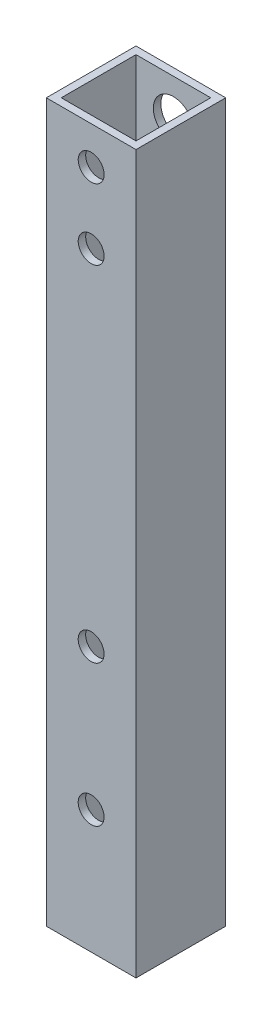
ISO-10303-21;
HEADER;
FILE_DESCRIPTION(('STEP AP214'),'2;1');
FILE_NAME('part.step','',(''),(''),'','','');
FILE_SCHEMA(('AUTOMOTIVE_DESIGN { 1 0 10303 214 1 1 1 1 }'));
ENDSEC;
DATA;
#1=APPLICATION_CONTEXT('core data for automotive mechanical design processes');
#2=APPLICATION_PROTOCOL_DEFINITION('international standard','automotive_design',2000,#1);
#3=PRODUCT_CONTEXT('',#1,'mechanical');
#4=PRODUCT('Part','Part','',(#3));
#5=PRODUCT_RELATED_PRODUCT_CATEGORY('part','',(#4));
#6=PRODUCT_DEFINITION_FORMATION('','',#4);
#7=PRODUCT_DEFINITION_CONTEXT('part definition',#1,'design');
#8=PRODUCT_DEFINITION('design','',#6,#7);
#9=PRODUCT_DEFINITION_SHAPE('','',#8);
#10=(LENGTH_UNIT() NAMED_UNIT(*) SI_UNIT(.MILLI.,.METRE.));
#11=(NAMED_UNIT(*) PLANE_ANGLE_UNIT() SI_UNIT($,.RADIAN.));
#12=(NAMED_UNIT(*) SI_UNIT($,.STERADIAN.) SOLID_ANGLE_UNIT());
#13=UNCERTAINTY_MEASURE_WITH_UNIT(LENGTH_MEASURE(1.E-05),#10,'distance_accuracy_value','');
#14=(GEOMETRIC_REPRESENTATION_CONTEXT(3) GLOBAL_UNCERTAINTY_ASSIGNED_CONTEXT((#13)) GLOBAL_UNIT_ASSIGNED_CONTEXT((#10,
#11,#12)) REPRESENTATION_CONTEXT('',''));
#15=CARTESIAN_POINT('',(0.,0.,0.));
#16=DIRECTION('',(0.,0.,1.));
#17=DIRECTION('',(1.,0.,0.));
#18=AXIS2_PLACEMENT_3D('',#15,#16,#17);
#19=CARTESIAN_POINT('',(0.,914.4,0.));
#20=DIRECTION('',(0.,-1.,0.));
#21=DIRECTION('',(0.,0.,-1.));
#22=AXIS2_PLACEMENT_3D('',#19,#20,#21);
#23=PLANE('',#22);
#24=DIRECTION('',(0.,0.,1.));
#25=VECTOR('',#24,1.);
#26=CARTESIAN_POINT('',(0.,914.4,0.));
#27=LINE('',#26,#25);
#28=CARTESIAN_POINT('',(0.,914.4,-19.05));
#29=VERTEX_POINT('',#28);
#30=CARTESIAN_POINT('',(0.,914.4,0.));
#31=VERTEX_POINT('',#30);
#32=EDGE_CURVE('E250',#29,#31,#27,.T.);
#33=ORIENTED_EDGE('',*,*,#32,.T.);
#34=DIRECTION('',(1.,0.,0.));
#35=VECTOR('',#34,1.);
#36=CARTESIAN_POINT('',(0.,914.4,0.));
#37=LINE('',#36,#35);
#38=CARTESIAN_POINT('',(19.05,914.4,0.));
#39=VERTEX_POINT('',#38);
#40=EDGE_CURVE('E254',#31,#39,#37,.T.);
#41=ORIENTED_EDGE('',*,*,#40,.T.);
#42=DIRECTION('',(0.,0.,-1.));
#43=VECTOR('',#42,1.);
#44=CARTESIAN_POINT('',(19.05,914.4,0.));
#45=LINE('',#44,#43);
#46=CARTESIAN_POINT('',(19.05,914.4,-19.05));
#47=VERTEX_POINT('',#46);
#48=EDGE_CURVE('E257',#39,#47,#45,.T.);
#49=ORIENTED_EDGE('',*,*,#48,.T.);
#50=DIRECTION('',(-1.,0.,0.));
#51=VECTOR('',#50,1.);
#52=CARTESIAN_POINT('',(0.,914.4,-19.05));
#53=LINE('',#52,#51);
#54=EDGE_CURVE('E133',#47,#29,#53,.T.);
#55=ORIENTED_EDGE('',*,*,#54,.T.);
#56=EDGE_LOOP('',(#33,#41,#49,#55));
#57=FACE_BOUND('',#56,.T.);
#58=DIRECTION('',(0.,0.,1.));
#59=VECTOR('',#58,1.);
#60=CARTESIAN_POINT('',(1.5875,914.4,-1.5875));
#61=LINE('',#60,#59);
#62=CARTESIAN_POINT('',(1.5875,914.4,-17.4625));
#63=VERTEX_POINT('',#62);
#64=CARTESIAN_POINT('',(1.5875,914.4,-1.5875));
#65=VERTEX_POINT('',#64);
#66=EDGE_CURVE('E221',#63,#65,#61,.T.);
#67=ORIENTED_EDGE('',*,*,#66,.F.);
#68=DIRECTION('',(-1.,0.,0.));
#69=VECTOR('',#68,1.);
#70=CARTESIAN_POINT('',(1.5875,914.4,-17.4625));
#71=LINE('',#70,#69);
#72=CARTESIAN_POINT('',(17.4625,914.4,-17.4625));
#73=VERTEX_POINT('',#72);
#74=EDGE_CURVE('E231',#73,#63,#71,.T.);
#75=ORIENTED_EDGE('',*,*,#74,.F.);
#76=DIRECTION('',(0.,0.,-1.));
#77=VECTOR('',#76,1.);
#78=CARTESIAN_POINT('',(17.4625,914.4,-1.5875));
#79=LINE('',#78,#77);
#80=CARTESIAN_POINT('',(17.4625,914.4,-1.5875));
#81=VERTEX_POINT('',#80);
#82=EDGE_CURVE('E227',#81,#73,#79,.T.);
#83=ORIENTED_EDGE('',*,*,#82,.F.);
#84=DIRECTION('',(1.,0.,0.));
#85=VECTOR('',#84,1.);
#86=CARTESIAN_POINT('',(1.5875,914.4,-1.5875));
#87=LINE('',#86,#85);
#88=EDGE_CURVE('E224',#65,#81,#87,.T.);
#89=ORIENTED_EDGE('',*,*,#88,.F.);
#90=EDGE_LOOP('',(#67,#75,#83,#89));
#91=FACE_BOUND('',#90,.T.);
#92=ADVANCED_FACE('F45',(#57,#91),#23,.F.);
#93=CARTESIAN_POINT('',(0.,914.4,0.));
#94=DIRECTION('',(1.,0.,0.));
#95=DIRECTION('',(0.,0.,-1.));
#96=AXIS2_PLACEMENT_3D('',#93,#94,#95);
#97=PLANE('',#96);
#98=DIRECTION('',(0.,-1.,0.));
#99=VECTOR('',#98,1.);
#100=CARTESIAN_POINT('',(0.,914.4,-19.05));
#101=LINE('',#100,#99);
#102=CARTESIAN_POINT('',(0.,762.,-19.05));
#103=VERTEX_POINT('',#102);
#104=EDGE_CURVE('E135',#29,#103,#101,.T.);
#105=ORIENTED_EDGE('',*,*,#104,.T.);
#106=DIRECTION('',(0.,0.,1.));
#107=VECTOR('',#106,1.);
#108=CARTESIAN_POINT('',(0.,762.,-19.05));
#109=LINE('',#108,#107);
#110=CARTESIAN_POINT('',(0.,762.,0.));
#111=VERTEX_POINT('',#110);
#112=EDGE_CURVE('E63',#103,#111,#109,.T.);
#113=ORIENTED_EDGE('',*,*,#112,.T.);
#114=DIRECTION('',(0.,-1.,0.));
#115=VECTOR('',#114,1.);
#116=CARTESIAN_POINT('',(0.,914.4,0.));
#117=LINE('',#116,#115);
#118=EDGE_CURVE('E55',#31,#111,#117,.T.);
#119=ORIENTED_EDGE('',*,*,#118,.F.);
#120=ORIENTED_EDGE('',*,*,#32,.F.);
#121=EDGE_LOOP('',(#105,#113,#119,#120));
#122=FACE_BOUND('',#121,.T.);
#123=ADVANCED_FACE('F47',(#122),#97,.F.);
#124=CARTESIAN_POINT('',(0.,914.4,0.));
#125=DIRECTION('',(0.,0.,-1.));
#126=DIRECTION('',(-1.,0.,0.));
#127=AXIS2_PLACEMENT_3D('',#124,#125,#126);
#128=PLANE('',#127);
#129=CARTESIAN_POINT('',(9.52,788.2,0.));
#130=DIRECTION('',(0.,0.,1.));
#131=DIRECTION('',(1.,0.,0.));
#132=AXIS2_PLACEMENT_3D('',#129,#130,#131);
#133=CIRCLE('',#132,2.74999999999998);
#134=CARTESIAN_POINT('',(12.27,788.2,0.));
#135=VERTEX_POINT('',#134);
#136=EDGE_CURVE('E157',#135,#135,#133,.T.);
#137=ORIENTED_EDGE('',*,*,#136,.F.);
#138=EDGE_LOOP('',(#137));
#139=FACE_BOUND('',#138,.T.);
#140=CARTESIAN_POINT('',(9.52,818.2,0.));
#141=DIRECTION('',(0.,0.,1.));
#142=DIRECTION('',(1.,0.,0.));
#143=AXIS2_PLACEMENT_3D('',#140,#141,#142);
#144=CIRCLE('',#143,2.74999999999998);
#145=CARTESIAN_POINT('',(12.27,818.2,0.));
#146=VERTEX_POINT('',#145);
#147=EDGE_CURVE('E163',#146,#146,#144,.T.);
#148=ORIENTED_EDGE('',*,*,#147,.F.);
#149=EDGE_LOOP('',(#148));
#150=FACE_BOUND('',#149,.T.);
#151=CARTESIAN_POINT('',(9.525,906.4,0.));
#152=DIRECTION('',(0.,0.,1.));
#153=DIRECTION('',(1.,0.,0.));
#154=AXIS2_PLACEMENT_3D('',#151,#152,#153);
#155=CIRCLE('',#154,2.74999999999998);
#156=CARTESIAN_POINT('',(12.275,906.4,0.));
#157=VERTEX_POINT('',#156);
#158=EDGE_CURVE('E206',#157,#157,#155,.T.);
#159=ORIENTED_EDGE('',*,*,#158,.F.);
#160=EDGE_LOOP('',(#159));
#161=FACE_BOUND('',#160,.T.);
#162=CARTESIAN_POINT('',(9.525,891.4,0.));
#163=DIRECTION('',(0.,0.,1.));
#164=DIRECTION('',(1.,0.,0.));
#165=AXIS2_PLACEMENT_3D('',#162,#163,#164);
#166=CIRCLE('',#165,2.74999999999998);
#167=CARTESIAN_POINT('',(12.275,891.4,0.));
#168=VERTEX_POINT('',#167);
#169=EDGE_CURVE('E194',#168,#168,#166,.T.);
#170=ORIENTED_EDGE('',*,*,#169,.F.);
#171=EDGE_LOOP('',(#170));
#172=FACE_BOUND('',#171,.T.);
#173=ORIENTED_EDGE('',*,*,#118,.T.);
#174=DIRECTION('',(-1.,0.,0.));
#175=VECTOR('',#174,1.);
#176=CARTESIAN_POINT('',(0.,762.,0.));
#177=LINE('',#176,#175);
#178=CARTESIAN_POINT('',(19.05,762.,0.));
#179=VERTEX_POINT('',#178);
#180=EDGE_CURVE('E119',#179,#111,#177,.T.);
#181=ORIENTED_EDGE('',*,*,#180,.F.);
#182=DIRECTION('',(0.,-1.,0.));
#183=VECTOR('',#182,1.);
#184=CARTESIAN_POINT('',(19.05,914.4,0.));
#185=LINE('',#184,#183);
#186=EDGE_CURVE('E129',#39,#179,#185,.T.);
#187=ORIENTED_EDGE('',*,*,#186,.F.);
#188=ORIENTED_EDGE('',*,*,#40,.F.);
#189=EDGE_LOOP('',(#173,#181,#187,#188));
#190=FACE_BOUND('',#189,.T.);
#191=ADVANCED_FACE('F266',(#139,#150,#161,#172,#190),#128,.F.);
#192=CARTESIAN_POINT('',(19.05,914.4,0.));
#193=DIRECTION('',(-1.,0.,0.));
#194=DIRECTION('',(0.,0.,1.));
#195=AXIS2_PLACEMENT_3D('',#192,#193,#194);
#196=PLANE('',#195);
#197=ORIENTED_EDGE('',*,*,#186,.T.);
#198=DIRECTION('',(0.,0.,1.));
#199=VECTOR('',#198,1.);
#200=CARTESIAN_POINT('',(19.05,762.,-19.05));
#201=LINE('',#200,#199);
#202=CARTESIAN_POINT('',(19.05,762.,-19.05));
#203=VERTEX_POINT('',#202);
#204=EDGE_CURVE('E112',#203,#179,#201,.T.);
#205=ORIENTED_EDGE('',*,*,#204,.F.);
#206=DIRECTION('',(0.,-1.,0.));
#207=VECTOR('',#206,1.);
#208=CARTESIAN_POINT('',(19.05,914.4,-19.05));
#209=LINE('',#208,#207);
#210=EDGE_CURVE('E126',#47,#203,#209,.T.);
#211=ORIENTED_EDGE('',*,*,#210,.F.);
#212=ORIENTED_EDGE('',*,*,#48,.F.);
#213=EDGE_LOOP('',(#197,#205,#211,#212));
#214=FACE_BOUND('',#213,.T.);
#215=ADVANCED_FACE('F124',(#214),#196,.F.);
#216=CARTESIAN_POINT('',(0.,914.4,-19.05));
#217=DIRECTION('',(0.,0.,1.));
#218=DIRECTION('',(1.,0.,0.));
#219=AXIS2_PLACEMENT_3D('',#216,#217,#218);
#220=PLANE('',#219);
#221=CARTESIAN_POINT('',(9.52,788.2,-19.05));
#222=DIRECTION('',(0.,0.,1.));
#223=DIRECTION('',(1.,0.,0.));
#224=AXIS2_PLACEMENT_3D('',#221,#222,#223);
#225=CIRCLE('',#224,2.74999999999998);
#226=CARTESIAN_POINT('',(12.27,788.2,-19.05));
#227=VERTEX_POINT('',#226);
#228=EDGE_CURVE('E149',#227,#227,#225,.T.);
#229=ORIENTED_EDGE('',*,*,#228,.T.);
#230=EDGE_LOOP('',(#229));
#231=FACE_BOUND('',#230,.T.);
#232=CARTESIAN_POINT('',(9.52,818.2,-19.05));
#233=DIRECTION('',(0.,0.,1.));
#234=DIRECTION('',(1.,0.,0.));
#235=AXIS2_PLACEMENT_3D('',#232,#233,#234);
#236=CIRCLE('',#235,2.74999999999998);
#237=CARTESIAN_POINT('',(12.27,818.2,-19.05));
#238=VERTEX_POINT('',#237);
#239=EDGE_CURVE('E169',#238,#238,#236,.T.);
#240=ORIENTED_EDGE('',*,*,#239,.T.);
#241=EDGE_LOOP('',(#240));
#242=FACE_BOUND('',#241,.T.);
#243=CARTESIAN_POINT('',(9.525,906.4,-19.05));
#244=DIRECTION('',(0.,0.,-1.));
#245=DIRECTION('',(-1.,0.,0.));
#246=AXIS2_PLACEMENT_3D('',#243,#244,#245);
#247=CIRCLE('',#246,4.255);
#248=CARTESIAN_POINT('',(5.26999999999999,906.4,-19.05));
#249=VERTEX_POINT('',#248);
#250=EDGE_CURVE('E190',#249,#249,#247,.T.);
#251=ORIENTED_EDGE('',*,*,#250,.F.);
#252=EDGE_LOOP('',(#251));
#253=FACE_BOUND('',#252,.T.);
#254=CARTESIAN_POINT('',(9.525,891.4,-19.05));
#255=DIRECTION('',(0.,0.,-1.));
#256=DIRECTION('',(-1.,0.,0.));
#257=AXIS2_PLACEMENT_3D('',#254,#255,#256);
#258=CIRCLE('',#257,4.255);
#259=CARTESIAN_POINT('',(5.26999999999999,891.4,-19.05));
#260=VERTEX_POINT('',#259);
#261=EDGE_CURVE('E189',#260,#260,#258,.T.);
#262=ORIENTED_EDGE('',*,*,#261,.F.);
#263=EDGE_LOOP('',(#262));
#264=FACE_BOUND('',#263,.T.);
#265=ORIENTED_EDGE('',*,*,#210,.T.);
#266=DIRECTION('',(-1.,0.,0.));
#267=VECTOR('',#266,1.);
#268=CARTESIAN_POINT('',(0.,762.,-19.05));
#269=LINE('',#268,#267);
#270=EDGE_CURVE('E109',#203,#103,#269,.T.);
#271=ORIENTED_EDGE('',*,*,#270,.T.);
#272=ORIENTED_EDGE('',*,*,#104,.F.);
#273=ORIENTED_EDGE('',*,*,#54,.F.);
#274=EDGE_LOOP('',(#265,#271,#272,#273));
#275=FACE_BOUND('',#274,.T.);
#276=ADVANCED_FACE('F132',(#231,#242,#253,#264,#275),#220,.F.);
#277=CARTESIAN_POINT('',(1.5875,914.4,-1.5875));
#278=DIRECTION('',(1.,0.,0.));
#279=DIRECTION('',(0.,0.,-1.));
#280=AXIS2_PLACEMENT_3D('',#277,#278,#279);
#281=PLANE('',#280);
#282=DIRECTION('',(0.,0.,1.));
#283=VECTOR('',#282,1.);
#284=CARTESIAN_POINT('',(1.5875,762.,-1.5875));
#285=LINE('',#284,#283);
#286=CARTESIAN_POINT('',(1.5875,762.,-17.4625));
#287=VERTEX_POINT('',#286);
#288=CARTESIAN_POINT('',(1.5875,762.,-1.5875));
#289=VERTEX_POINT('',#288);
#290=EDGE_CURVE('E186',#287,#289,#285,.T.);
#291=ORIENTED_EDGE('',*,*,#290,.F.);
#292=DIRECTION('',(0.,-1.,0.));
#293=VECTOR('',#292,1.);
#294=CARTESIAN_POINT('',(1.5875,914.4,-17.4625));
#295=LINE('',#294,#293);
#296=EDGE_CURVE('E234',#63,#287,#295,.T.);
#297=ORIENTED_EDGE('',*,*,#296,.F.);
#298=ORIENTED_EDGE('',*,*,#66,.T.);
#299=DIRECTION('',(0.,-1.,0.));
#300=VECTOR('',#299,1.);
#301=CARTESIAN_POINT('',(1.5875,914.4,-1.5875));
#302=LINE('',#301,#300);
#303=EDGE_CURVE('E246',#65,#289,#302,.T.);
#304=ORIENTED_EDGE('',*,*,#303,.T.);
#305=EDGE_LOOP('',(#291,#297,#298,#304));
#306=FACE_BOUND('',#305,.T.);
#307=ADVANCED_FACE('F282',(#306),#281,.T.);
#308=CARTESIAN_POINT('',(1.5875,914.4,-1.5875));
#309=DIRECTION('',(0.,0.,-1.));
#310=DIRECTION('',(-1.,0.,0.));
#311=AXIS2_PLACEMENT_3D('',#308,#309,#310);
#312=PLANE('',#311);
#313=CARTESIAN_POINT('',(9.52,788.2,-1.5875));
#314=DIRECTION('',(0.,0.,-1.));
#315=DIRECTION('',(-1.,0.,0.));
#316=AXIS2_PLACEMENT_3D('',#313,#314,#315);
#317=CIRCLE('',#316,2.74999999999998);
#318=CARTESIAN_POINT('',(6.77000000000002,788.2,-1.5875));
#319=VERTEX_POINT('',#318);
#320=EDGE_CURVE('E173',#319,#319,#317,.T.);
#321=ORIENTED_EDGE('',*,*,#320,.F.);
#322=EDGE_LOOP('',(#321));
#323=FACE_BOUND('',#322,.T.);
#324=CARTESIAN_POINT('',(9.52,818.2,-1.5875));
#325=DIRECTION('',(0.,0.,-1.));
#326=DIRECTION('',(-1.,0.,0.));
#327=AXIS2_PLACEMENT_3D('',#324,#325,#326);
#328=CIRCLE('',#327,2.74999999999998);
#329=CARTESIAN_POINT('',(6.77000000000002,818.2,-1.5875));
#330=VERTEX_POINT('',#329);
#331=EDGE_CURVE('E148',#330,#330,#328,.T.);
#332=ORIENTED_EDGE('',*,*,#331,.F.);
#333=EDGE_LOOP('',(#332));
#334=FACE_BOUND('',#333,.T.);
#335=DIRECTION('',(1.,0.,0.));
#336=VECTOR('',#335,1.);
#337=CARTESIAN_POINT('',(1.5875,762.,-1.5875));
#338=LINE('',#337,#336);
#339=CARTESIAN_POINT('',(17.4625,762.,-1.5875));
#340=VERTEX_POINT('',#339);
#341=EDGE_CURVE('E183',#289,#340,#338,.T.);
#342=ORIENTED_EDGE('',*,*,#341,.F.);
#343=ORIENTED_EDGE('',*,*,#303,.F.);
#344=ORIENTED_EDGE('',*,*,#88,.T.);
#345=DIRECTION('',(0.,-1.,0.));
#346=VECTOR('',#345,1.);
#347=CARTESIAN_POINT('',(17.4625,914.4,-1.5875));
#348=LINE('',#347,#346);
#349=EDGE_CURVE('E242',#81,#340,#348,.T.);
#350=ORIENTED_EDGE('',*,*,#349,.T.);
#351=EDGE_LOOP('',(#342,#343,#344,#350));
#352=FACE_BOUND('',#351,.T.);
#353=CARTESIAN_POINT('',(9.525,906.4,-1.5875));
#354=DIRECTION('',(0.,0.,-1.));
#355=DIRECTION('',(-1.,0.,0.));
#356=AXIS2_PLACEMENT_3D('',#353,#354,#355);
#357=CIRCLE('',#356,2.74999999999998);
#358=CARTESIAN_POINT('',(6.77500000000001,906.4,-1.5875));
#359=VERTEX_POINT('',#358);
#360=EDGE_CURVE('E217',#359,#359,#357,.T.);
#361=ORIENTED_EDGE('',*,*,#360,.F.);
#362=EDGE_LOOP('',(#361));
#363=FACE_BOUND('',#362,.T.);
#364=CARTESIAN_POINT('',(9.525,891.4,-1.5875));
#365=DIRECTION('',(0.,0.,-1.));
#366=DIRECTION('',(-1.,0.,0.));
#367=AXIS2_PLACEMENT_3D('',#364,#365,#366);
#368=CIRCLE('',#367,2.74999999999998);
#369=CARTESIAN_POINT('',(6.77500000000001,891.4,-1.5875));
#370=VERTEX_POINT('',#369);
#371=EDGE_CURVE('E210',#370,#370,#368,.T.);
#372=ORIENTED_EDGE('',*,*,#371,.F.);
#373=EDGE_LOOP('',(#372));
#374=FACE_BOUND('',#373,.T.);
#375=ADVANCED_FACE('F288',(#323,#334,#352,#363,#374),#312,.T.);
#376=CARTESIAN_POINT('',(17.4625,914.4,-1.5875));
#377=DIRECTION('',(-1.,0.,0.));
#378=DIRECTION('',(0.,0.,1.));
#379=AXIS2_PLACEMENT_3D('',#376,#377,#378);
#380=PLANE('',#379);
#381=DIRECTION('',(0.,0.,-1.));
#382=VECTOR('',#381,1.);
#383=CARTESIAN_POINT('',(17.4625,762.,-1.5875));
#384=LINE('',#383,#382);
#385=CARTESIAN_POINT('',(17.4625,762.,-17.4625));
#386=VERTEX_POINT('',#385);
#387=EDGE_CURVE('E70',#340,#386,#384,.T.);
#388=ORIENTED_EDGE('',*,*,#387,.F.);
#389=ORIENTED_EDGE('',*,*,#349,.F.);
#390=ORIENTED_EDGE('',*,*,#82,.T.);
#391=DIRECTION('',(0.,-1.,0.));
#392=VECTOR('',#391,1.);
#393=CARTESIAN_POINT('',(17.4625,914.4,-17.4625));
#394=LINE('',#393,#392);
#395=EDGE_CURVE('E238',#73,#386,#394,.T.);
#396=ORIENTED_EDGE('',*,*,#395,.T.);
#397=EDGE_LOOP('',(#388,#389,#390,#396));
#398=FACE_BOUND('',#397,.T.);
#399=ADVANCED_FACE('F321',(#398),#380,.T.);
#400=CARTESIAN_POINT('',(1.5875,914.4,-17.4625));
#401=DIRECTION('',(0.,0.,1.));
#402=DIRECTION('',(1.,0.,0.));
#403=AXIS2_PLACEMENT_3D('',#400,#401,#402);
#404=PLANE('',#403);
#405=CARTESIAN_POINT('',(9.52,788.2,-17.4625));
#406=DIRECTION('',(0.,0.,1.));
#407=DIRECTION('',(1.,0.,0.));
#408=AXIS2_PLACEMENT_3D('',#405,#406,#407);
#409=CIRCLE('',#408,2.74999999999998);
#410=CARTESIAN_POINT('',(12.27,788.2,-17.4625));
#411=VERTEX_POINT('',#410);
#412=EDGE_CURVE('E49',#411,#411,#409,.T.);
#413=ORIENTED_EDGE('',*,*,#412,.F.);
#414=EDGE_LOOP('',(#413));
#415=FACE_BOUND('',#414,.T.);
#416=CARTESIAN_POINT('',(9.52,818.2,-17.4625));
#417=DIRECTION('',(0.,0.,1.));
#418=DIRECTION('',(1.,0.,0.));
#419=AXIS2_PLACEMENT_3D('',#416,#417,#418);
#420=CIRCLE('',#419,2.74999999999998);
#421=CARTESIAN_POINT('',(12.27,818.2,-17.4625));
#422=VERTEX_POINT('',#421);
#423=EDGE_CURVE('E145',#422,#422,#420,.T.);
#424=ORIENTED_EDGE('',*,*,#423,.F.);
#425=EDGE_LOOP('',(#424));
#426=FACE_BOUND('',#425,.T.);
#427=DIRECTION('',(-1.,0.,0.));
#428=VECTOR('',#427,1.);
#429=CARTESIAN_POINT('',(1.5875,762.,-17.4625));
#430=LINE('',#429,#428);
#431=EDGE_CURVE('E11',#386,#287,#430,.T.);
#432=ORIENTED_EDGE('',*,*,#431,.F.);
#433=ORIENTED_EDGE('',*,*,#395,.F.);
#434=ORIENTED_EDGE('',*,*,#74,.T.);
#435=ORIENTED_EDGE('',*,*,#296,.T.);
#436=EDGE_LOOP('',(#432,#433,#434,#435));
#437=FACE_BOUND('',#436,.T.);
#438=CARTESIAN_POINT('',(9.525,906.4,-17.4625));
#439=DIRECTION('',(0.,0.,1.));
#440=DIRECTION('',(1.,0.,0.));
#441=AXIS2_PLACEMENT_3D('',#438,#439,#440);
#442=CIRCLE('',#441,4.255);
#443=CARTESIAN_POINT('',(13.78,906.4,-17.4625));
#444=VERTEX_POINT('',#443);
#445=EDGE_CURVE('E195',#444,#444,#442,.F.);
#446=ORIENTED_EDGE('',*,*,#445,.T.);
#447=EDGE_LOOP('',(#446));
#448=FACE_BOUND('',#447,.T.);
#449=CARTESIAN_POINT('',(9.525,891.4,-17.4625));
#450=DIRECTION('',(0.,0.,1.));
#451=DIRECTION('',(1.,0.,0.));
#452=AXIS2_PLACEMENT_3D('',#449,#450,#451);
#453=CIRCLE('',#452,4.255);
#454=CARTESIAN_POINT('',(13.78,891.4,-17.4625));
#455=VERTEX_POINT('',#454);
#456=EDGE_CURVE('E199',#455,#455,#453,.F.);
#457=ORIENTED_EDGE('',*,*,#456,.T.);
#458=EDGE_LOOP('',(#457));
#459=FACE_BOUND('',#458,.T.);
#460=ADVANCED_FACE('F317',(#415,#426,#437,#448,#459),#404,.T.);
#461=CARTESIAN_POINT('',(9.525,891.4,-19.05));
#462=DIRECTION('',(0.,0.,1.));
#463=DIRECTION('',(1.,0.,0.));
#464=AXIS2_PLACEMENT_3D('',#461,#462,#463);
#465=CYLINDRICAL_SURFACE('',#464,2.74999999999998);
#466=ORIENTED_EDGE('',*,*,#371,.T.);
#467=EDGE_LOOP('',(#466));
#468=FACE_BOUND('',#467,.T.);
#469=ORIENTED_EDGE('',*,*,#169,.T.);
#470=EDGE_LOOP('',(#469));
#471=FACE_BOUND('',#470,.T.);
#472=ADVANCED_FACE('F309',(#468,#471),#465,.F.);
#473=CARTESIAN_POINT('',(9.525,906.4,-19.05));
#474=DIRECTION('',(0.,0.,1.));
#475=DIRECTION('',(1.,0.,0.));
#476=AXIS2_PLACEMENT_3D('',#473,#474,#475);
#477=CYLINDRICAL_SURFACE('',#476,2.74999999999998);
#478=ORIENTED_EDGE('',*,*,#360,.T.);
#479=EDGE_LOOP('',(#478));
#480=FACE_BOUND('',#479,.T.);
#481=ORIENTED_EDGE('',*,*,#158,.T.);
#482=EDGE_LOOP('',(#481));
#483=FACE_BOUND('',#482,.T.);
#484=ADVANCED_FACE('F300',(#480,#483),#477,.F.);
#485=CARTESIAN_POINT('',(9.525,891.4,0.001000000000001));
#486=DIRECTION('',(0.,0.,-1.));
#487=DIRECTION('',(-1.,0.,0.));
#488=AXIS2_PLACEMENT_3D('',#485,#486,#487);
#489=CYLINDRICAL_SURFACE('',#488,4.255);
#490=ORIENTED_EDGE('',*,*,#456,.F.);
#491=EDGE_LOOP('',(#490));
#492=FACE_BOUND('',#491,.T.);
#493=ORIENTED_EDGE('',*,*,#261,.T.);
#494=EDGE_LOOP('',(#493));
#495=FACE_BOUND('',#494,.T.);
#496=ADVANCED_FACE('F297',(#492,#495),#489,.F.);
#497=CARTESIAN_POINT('',(9.525,906.4,0.001000000000001));
#498=DIRECTION('',(0.,0.,-1.));
#499=DIRECTION('',(-1.,0.,0.));
#500=AXIS2_PLACEMENT_3D('',#497,#498,#499);
#501=CYLINDRICAL_SURFACE('',#500,4.255);
#502=ORIENTED_EDGE('',*,*,#445,.F.);
#503=EDGE_LOOP('',(#502));
#504=FACE_BOUND('',#503,.T.);
#505=ORIENTED_EDGE('',*,*,#250,.T.);
#506=EDGE_LOOP('',(#505));
#507=FACE_BOUND('',#506,.T.);
#508=ADVANCED_FACE('F299',(#504,#507),#501,.F.);
#509=CARTESIAN_POINT('',(0.,762.,-19.05));
#510=DIRECTION('',(0.,1.,0.));
#511=DIRECTION('',(0.,0.,1.));
#512=AXIS2_PLACEMENT_3D('',#509,#510,#511);
#513=PLANE('',#512);
#514=ORIENTED_EDGE('',*,*,#290,.T.);
#515=ORIENTED_EDGE('',*,*,#341,.T.);
#516=ORIENTED_EDGE('',*,*,#387,.T.);
#517=ORIENTED_EDGE('',*,*,#431,.T.);
#518=EDGE_LOOP('',(#514,#515,#516,#517));
#519=FACE_BOUND('',#518,.T.);
#520=ORIENTED_EDGE('',*,*,#180,.T.);
#521=ORIENTED_EDGE('',*,*,#112,.F.);
#522=ORIENTED_EDGE('',*,*,#270,.F.);
#523=ORIENTED_EDGE('',*,*,#204,.T.);
#524=EDGE_LOOP('',(#520,#521,#522,#523));
#525=FACE_BOUND('',#524,.T.);
#526=ADVANCED_FACE('F111',(#519,#525),#513,.F.);
#527=CARTESIAN_POINT('',(9.52,818.2,-19.05));
#528=DIRECTION('',(0.,0.,1.));
#529=DIRECTION('',(1.,0.,0.));
#530=AXIS2_PLACEMENT_3D('',#527,#528,#529);
#531=CYLINDRICAL_SURFACE('',#530,2.74999999999998);
#532=ORIENTED_EDGE('',*,*,#423,.T.);
#533=EDGE_LOOP('',(#532));
#534=FACE_BOUND('',#533,.T.);
#535=ORIENTED_EDGE('',*,*,#239,.F.);
#536=EDGE_LOOP('',(#535));
#537=FACE_BOUND('',#536,.T.);
#538=ADVANCED_FACE('F355',(#534,#537),#531,.F.);
#539=CARTESIAN_POINT('',(9.52,788.2,-19.05));
#540=DIRECTION('',(0.,0.,1.));
#541=DIRECTION('',(1.,0.,0.));
#542=AXIS2_PLACEMENT_3D('',#539,#540,#541);
#543=CYLINDRICAL_SURFACE('',#542,2.74999999999998);
#544=ORIENTED_EDGE('',*,*,#412,.T.);
#545=EDGE_LOOP('',(#544));
#546=FACE_BOUND('',#545,.T.);
#547=ORIENTED_EDGE('',*,*,#228,.F.);
#548=EDGE_LOOP('',(#547));
#549=FACE_BOUND('',#548,.T.);
#550=ADVANCED_FACE('F359',(#546,#549),#543,.F.);
#551=ORIENTED_EDGE('',*,*,#331,.T.);
#552=EDGE_LOOP('',(#551));
#553=FACE_BOUND('',#552,.T.);
#554=ORIENTED_EDGE('',*,*,#147,.T.);
#555=EDGE_LOOP('',(#554));
#556=FACE_BOUND('',#555,.T.);
#557=ADVANCED_FACE('F361',(#553,#556),#531,.F.);
#558=ORIENTED_EDGE('',*,*,#320,.T.);
#559=EDGE_LOOP('',(#558));
#560=FACE_BOUND('',#559,.T.);
#561=ORIENTED_EDGE('',*,*,#136,.T.);
#562=EDGE_LOOP('',(#561));
#563=FACE_BOUND('',#562,.T.);
#564=ADVANCED_FACE('F365',(#560,#563),#543,.F.);
#565=CLOSED_SHELL('',(#92,#123,#191,#215,#276,#307,#375,#399,#460,#472,#484,#496,#508,#526,#538,
#550,#557,#564));
#566=MANIFOLD_SOLID_BREP('B2',#565);
#567=ADVANCED_BREP_SHAPE_REPRESENTATION('',(#18,#566),#14);
#568=SHAPE_DEFINITION_REPRESENTATION(#9,#567);
ENDSEC;
END-ISO-10303-21;
